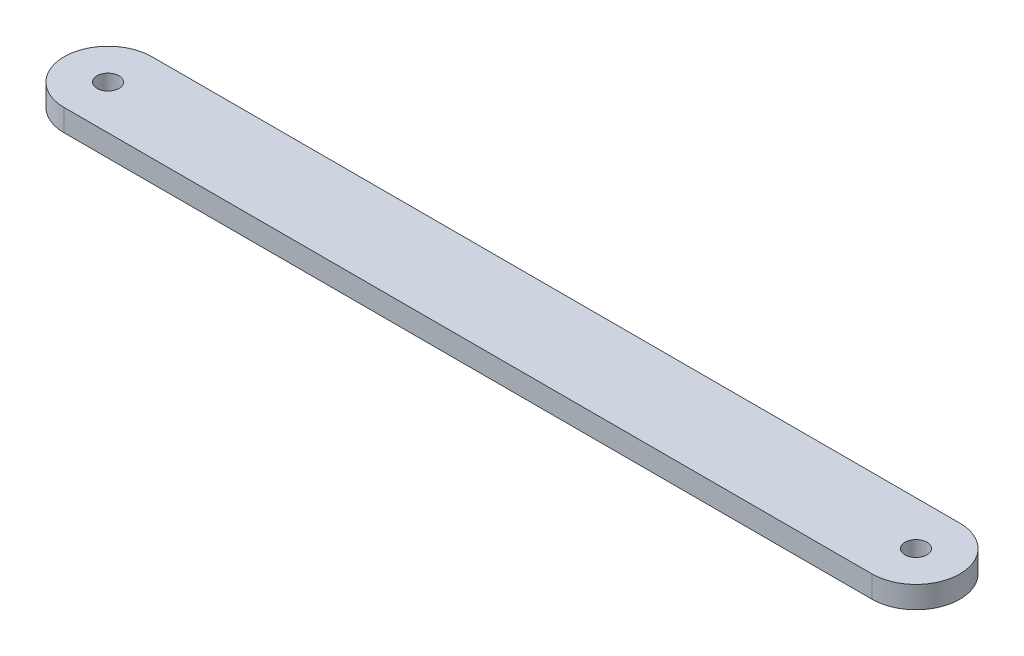
ISO-10303-21;
HEADER;
FILE_DESCRIPTION(('STEP AP214'),'2;1');
FILE_NAME('part.step','',(''),(''),'','','');
FILE_SCHEMA(('AUTOMOTIVE_DESIGN { 1 0 10303 214 1 1 1 1 }'));
ENDSEC;
DATA;
#1=APPLICATION_CONTEXT('core data for automotive mechanical design processes');
#2=APPLICATION_PROTOCOL_DEFINITION('international standard','automotive_design',2000,#1);
#3=PRODUCT_CONTEXT('',#1,'mechanical');
#4=PRODUCT('Part','Part','',(#3));
#5=PRODUCT_RELATED_PRODUCT_CATEGORY('part','',(#4));
#6=PRODUCT_DEFINITION_FORMATION('','',#4);
#7=PRODUCT_DEFINITION_CONTEXT('part definition',#1,'design');
#8=PRODUCT_DEFINITION('design','',#6,#7);
#9=PRODUCT_DEFINITION_SHAPE('','',#8);
#10=(LENGTH_UNIT() NAMED_UNIT(*) SI_UNIT(.MILLI.,.METRE.));
#11=(NAMED_UNIT(*) PLANE_ANGLE_UNIT() SI_UNIT($,.RADIAN.));
#12=(NAMED_UNIT(*) SI_UNIT($,.STERADIAN.) SOLID_ANGLE_UNIT());
#13=UNCERTAINTY_MEASURE_WITH_UNIT(LENGTH_MEASURE(1.E-05),#10,'distance_accuracy_value','');
#14=(GEOMETRIC_REPRESENTATION_CONTEXT(3) GLOBAL_UNCERTAINTY_ASSIGNED_CONTEXT((#13)) GLOBAL_UNIT_ASSIGNED_CONTEXT((#10,
#11,#12)) REPRESENTATION_CONTEXT('',''));
#15=CARTESIAN_POINT('',(0.,0.,0.));
#16=DIRECTION('',(0.,0.,1.));
#17=DIRECTION('',(1.,0.,0.));
#18=AXIS2_PLACEMENT_3D('',#15,#16,#17);
#19=CARTESIAN_POINT('',(0.,6.35,0.));
#20=DIRECTION('',(0.,1.,0.));
#21=DIRECTION('',(0.,0.,1.));
#22=AXIS2_PLACEMENT_3D('',#19,#20,#21);
#23=PLANE('',#22);
#24=CARTESIAN_POINT('',(0.,6.35,0.));
#25=DIRECTION('',(0.,1.,0.));
#26=DIRECTION('',(0.,0.,1.));
#27=AXIS2_PLACEMENT_3D('',#24,#25,#26);
#28=CIRCLE('',#27,3.17499999999999);
#29=CARTESIAN_POINT('',(0.,6.35,3.17499999999999));
#30=VERTEX_POINT('',#29);
#31=EDGE_CURVE('E100',#30,#30,#28,.T.);
#32=ORIENTED_EDGE('',*,*,#31,.F.);
#33=EDGE_LOOP('',(#32));
#34=FACE_BOUND('',#33,.T.);
#35=CARTESIAN_POINT('',(0.,6.35,0.));
#36=DIRECTION('',(0.,1.,0.));
#37=DIRECTION('',(0.,0.,1.));
#38=AXIS2_PLACEMENT_3D('',#35,#36,#37);
#39=CIRCLE('',#38,12.7);
#40=CARTESIAN_POINT('',(0.,6.35,-12.7));
#41=VERTEX_POINT('',#40);
#42=CARTESIAN_POINT('',(0.,6.35,12.7));
#43=VERTEX_POINT('',#42);
#44=EDGE_CURVE('E85',#41,#43,#39,.T.);
#45=ORIENTED_EDGE('',*,*,#44,.T.);
#46=DIRECTION('',(1.,0.,0.));
#47=VECTOR('',#46,1.);
#48=CARTESIAN_POINT('',(0.,6.35,12.7));
#49=LINE('',#48,#47);
#50=CARTESIAN_POINT('',(233.53,6.35,12.7));
#51=VERTEX_POINT('',#50);
#52=EDGE_CURVE('E80',#43,#51,#49,.T.);
#53=ORIENTED_EDGE('',*,*,#52,.T.);
#54=CARTESIAN_POINT('',(233.53,6.35,0.));
#55=DIRECTION('',(0.,1.,0.));
#56=DIRECTION('',(0.,0.,1.));
#57=AXIS2_PLACEMENT_3D('',#54,#55,#56);
#58=CIRCLE('',#57,12.7);
#59=CARTESIAN_POINT('',(233.53,6.35,-12.7));
#60=VERTEX_POINT('',#59);
#61=EDGE_CURVE('E83',#51,#60,#58,.T.);
#62=ORIENTED_EDGE('',*,*,#61,.T.);
#63=DIRECTION('',(-1.,0.,0.));
#64=VECTOR('',#63,1.);
#65=CARTESIAN_POINT('',(0.,6.35,-12.7));
#66=LINE('',#65,#64);
#67=EDGE_CURVE('E50',#60,#41,#66,.T.);
#68=ORIENTED_EDGE('',*,*,#67,.T.);
#69=EDGE_LOOP('',(#45,#53,#62,#68));
#70=FACE_BOUND('',#69,.T.);
#71=CARTESIAN_POINT('',(233.53,6.35,0.));
#72=DIRECTION('',(0.,1.,0.));
#73=DIRECTION('',(0.,0.,1.));
#74=AXIS2_PLACEMENT_3D('',#71,#72,#73);
#75=CIRCLE('',#74,3.175);
#76=CARTESIAN_POINT('',(233.53,6.35,3.175));
#77=VERTEX_POINT('',#76);
#78=EDGE_CURVE('E115',#77,#77,#75,.T.);
#79=ORIENTED_EDGE('',*,*,#78,.F.);
#80=EDGE_LOOP('',(#79));
#81=FACE_BOUND('',#80,.T.);
#82=ADVANCED_FACE('F33',(#34,#70,#81),#23,.T.);
#83=CARTESIAN_POINT('',(0.,0.,0.));
#84=DIRECTION('',(0.,1.,0.));
#85=DIRECTION('',(0.,0.,1.));
#86=AXIS2_PLACEMENT_3D('',#83,#84,#85);
#87=PLANE('',#86);
#88=CARTESIAN_POINT('',(0.,0.,0.));
#89=DIRECTION('',(0.,1.,0.));
#90=DIRECTION('',(0.,0.,1.));
#91=AXIS2_PLACEMENT_3D('',#88,#89,#90);
#92=CIRCLE('',#91,12.7);
#93=CARTESIAN_POINT('',(0.,0.,-12.7));
#94=VERTEX_POINT('',#93);
#95=CARTESIAN_POINT('',(0.,0.,12.7));
#96=VERTEX_POINT('',#95);
#97=EDGE_CURVE('E97',#94,#96,#92,.T.);
#98=ORIENTED_EDGE('',*,*,#97,.F.);
#99=DIRECTION('',(-1.,0.,0.));
#100=VECTOR('',#99,1.);
#101=CARTESIAN_POINT('',(0.,0.,-12.7));
#102=LINE('',#101,#100);
#103=CARTESIAN_POINT('',(233.53,0.,-12.7));
#104=VERTEX_POINT('',#103);
#105=EDGE_CURVE('E73',#104,#94,#102,.T.);
#106=ORIENTED_EDGE('',*,*,#105,.F.);
#107=CARTESIAN_POINT('',(233.53,0.,0.));
#108=DIRECTION('',(0.,1.,0.));
#109=DIRECTION('',(0.,0.,1.));
#110=AXIS2_PLACEMENT_3D('',#107,#108,#109);
#111=CIRCLE('',#110,12.7);
#112=CARTESIAN_POINT('',(233.53,0.,12.7));
#113=VERTEX_POINT('',#112);
#114=EDGE_CURVE('E67',#113,#104,#111,.T.);
#115=ORIENTED_EDGE('',*,*,#114,.F.);
#116=DIRECTION('',(1.,0.,0.));
#117=VECTOR('',#116,1.);
#118=CARTESIAN_POINT('',(0.,0.,12.7));
#119=LINE('',#118,#117);
#120=EDGE_CURVE('E89',#96,#113,#119,.T.);
#121=ORIENTED_EDGE('',*,*,#120,.F.);
#122=EDGE_LOOP('',(#98,#106,#115,#121));
#123=FACE_BOUND('',#122,.T.);
#124=CARTESIAN_POINT('',(0.,0.,0.));
#125=DIRECTION('',(0.,1.,0.));
#126=DIRECTION('',(0.,0.,1.));
#127=AXIS2_PLACEMENT_3D('',#124,#125,#126);
#128=CIRCLE('',#127,3.17499999999999);
#129=CARTESIAN_POINT('',(0.,0.,3.17499999999999));
#130=VERTEX_POINT('',#129);
#131=EDGE_CURVE('E112',#130,#130,#128,.T.);
#132=ORIENTED_EDGE('',*,*,#131,.T.);
#133=EDGE_LOOP('',(#132));
#134=FACE_BOUND('',#133,.T.);
#135=CARTESIAN_POINT('',(233.53,0.,0.));
#136=DIRECTION('',(0.,1.,0.));
#137=DIRECTION('',(0.,0.,1.));
#138=AXIS2_PLACEMENT_3D('',#135,#136,#137);
#139=CIRCLE('',#138,3.175);
#140=CARTESIAN_POINT('',(233.53,0.,3.175));
#141=VERTEX_POINT('',#140);
#142=EDGE_CURVE('E118',#141,#141,#139,.T.);
#143=ORIENTED_EDGE('',*,*,#142,.T.);
#144=EDGE_LOOP('',(#143));
#145=FACE_BOUND('',#144,.T.);
#146=ADVANCED_FACE('F108',(#123,#134,#145),#87,.F.);
#147=CARTESIAN_POINT('',(0.,6.35,0.));
#148=DIRECTION('',(0.,-1.,0.));
#149=DIRECTION('',(0.,0.,-1.));
#150=AXIS2_PLACEMENT_3D('',#147,#148,#149);
#151=CYLINDRICAL_SURFACE('',#150,12.7);
#152=ORIENTED_EDGE('',*,*,#97,.T.);
#153=DIRECTION('',(0.,-1.,0.));
#154=VECTOR('',#153,1.);
#155=CARTESIAN_POINT('',(0.,6.35,12.7));
#156=LINE('',#155,#154);
#157=EDGE_CURVE('E11',#43,#96,#156,.T.);
#158=ORIENTED_EDGE('',*,*,#157,.F.);
#159=ORIENTED_EDGE('',*,*,#44,.F.);
#160=DIRECTION('',(0.,-1.,0.));
#161=VECTOR('',#160,1.);
#162=CARTESIAN_POINT('',(0.,6.35,-12.7));
#163=LINE('',#162,#161);
#164=EDGE_CURVE('E93',#41,#94,#163,.T.);
#165=ORIENTED_EDGE('',*,*,#164,.T.);
#166=EDGE_LOOP('',(#152,#158,#159,#165));
#167=FACE_BOUND('',#166,.T.);
#168=ADVANCED_FACE('F35',(#167),#151,.T.);
#169=CARTESIAN_POINT('',(0.,6.35,12.7));
#170=DIRECTION('',(0.,0.,-1.));
#171=DIRECTION('',(-1.,0.,0.));
#172=AXIS2_PLACEMENT_3D('',#169,#170,#171);
#173=PLANE('',#172);
#174=ORIENTED_EDGE('',*,*,#120,.T.);
#175=DIRECTION('',(0.,-1.,0.));
#176=VECTOR('',#175,1.);
#177=CARTESIAN_POINT('',(233.53,6.35,12.7));
#178=LINE('',#177,#176);
#179=EDGE_CURVE('E42',#51,#113,#178,.T.);
#180=ORIENTED_EDGE('',*,*,#179,.F.);
#181=ORIENTED_EDGE('',*,*,#52,.F.);
#182=ORIENTED_EDGE('',*,*,#157,.T.);
#183=EDGE_LOOP('',(#174,#180,#181,#182));
#184=FACE_BOUND('',#183,.T.);
#185=ADVANCED_FACE('F88',(#184),#173,.F.);
#186=CARTESIAN_POINT('',(233.53,6.35,0.));
#187=DIRECTION('',(0.,-1.,0.));
#188=DIRECTION('',(0.,0.,-1.));
#189=AXIS2_PLACEMENT_3D('',#186,#187,#188);
#190=CYLINDRICAL_SURFACE('',#189,12.7);
#191=ORIENTED_EDGE('',*,*,#114,.T.);
#192=DIRECTION('',(0.,-1.,0.));
#193=VECTOR('',#192,1.);
#194=CARTESIAN_POINT('',(233.53,6.35,-12.7));
#195=LINE('',#194,#193);
#196=EDGE_CURVE('E90',#60,#104,#195,.T.);
#197=ORIENTED_EDGE('',*,*,#196,.F.);
#198=ORIENTED_EDGE('',*,*,#61,.F.);
#199=ORIENTED_EDGE('',*,*,#179,.T.);
#200=EDGE_LOOP('',(#191,#197,#198,#199));
#201=FACE_BOUND('',#200,.T.);
#202=ADVANCED_FACE('F91',(#201),#190,.T.);
#203=CARTESIAN_POINT('',(0.,6.35,-12.7));
#204=DIRECTION('',(0.,0.,1.));
#205=DIRECTION('',(1.,0.,0.));
#206=AXIS2_PLACEMENT_3D('',#203,#204,#205);
#207=PLANE('',#206);
#208=ORIENTED_EDGE('',*,*,#105,.T.);
#209=ORIENTED_EDGE('',*,*,#164,.F.);
#210=ORIENTED_EDGE('',*,*,#67,.F.);
#211=ORIENTED_EDGE('',*,*,#196,.T.);
#212=EDGE_LOOP('',(#208,#209,#210,#211));
#213=FACE_BOUND('',#212,.T.);
#214=ADVANCED_FACE('F105',(#213),#207,.F.);
#215=CARTESIAN_POINT('',(0.,6.35,0.));
#216=DIRECTION('',(0.,-1.,0.));
#217=DIRECTION('',(0.,0.,-1.));
#218=AXIS2_PLACEMENT_3D('',#215,#216,#217);
#219=CYLINDRICAL_SURFACE('',#218,3.17499999999999);
#220=ORIENTED_EDGE('',*,*,#31,.T.);
#221=EDGE_LOOP('',(#220));
#222=FACE_BOUND('',#221,.T.);
#223=ORIENTED_EDGE('',*,*,#131,.F.);
#224=EDGE_LOOP('',(#223));
#225=FACE_BOUND('',#224,.T.);
#226=ADVANCED_FACE('F135',(#222,#225),#219,.F.);
#227=CARTESIAN_POINT('',(233.53,6.35,0.));
#228=DIRECTION('',(0.,-1.,0.));
#229=DIRECTION('',(0.,0.,-1.));
#230=AXIS2_PLACEMENT_3D('',#227,#228,#229);
#231=CYLINDRICAL_SURFACE('',#230,3.175);
#232=ORIENTED_EDGE('',*,*,#78,.T.);
#233=EDGE_LOOP('',(#232));
#234=FACE_BOUND('',#233,.T.);
#235=ORIENTED_EDGE('',*,*,#142,.F.);
#236=EDGE_LOOP('',(#235));
#237=FACE_BOUND('',#236,.T.);
#238=ADVANCED_FACE('F124',(#234,#237),#231,.F.);
#239=CLOSED_SHELL('',(#82,#146,#168,#185,#202,#214,#226,#238));
#240=MANIFOLD_SOLID_BREP('B2',#239);
#241=ADVANCED_BREP_SHAPE_REPRESENTATION('',(#18,#240),#14);
#242=SHAPE_DEFINITION_REPRESENTATION(#9,#241);
ENDSEC;
END-ISO-10303-21;
